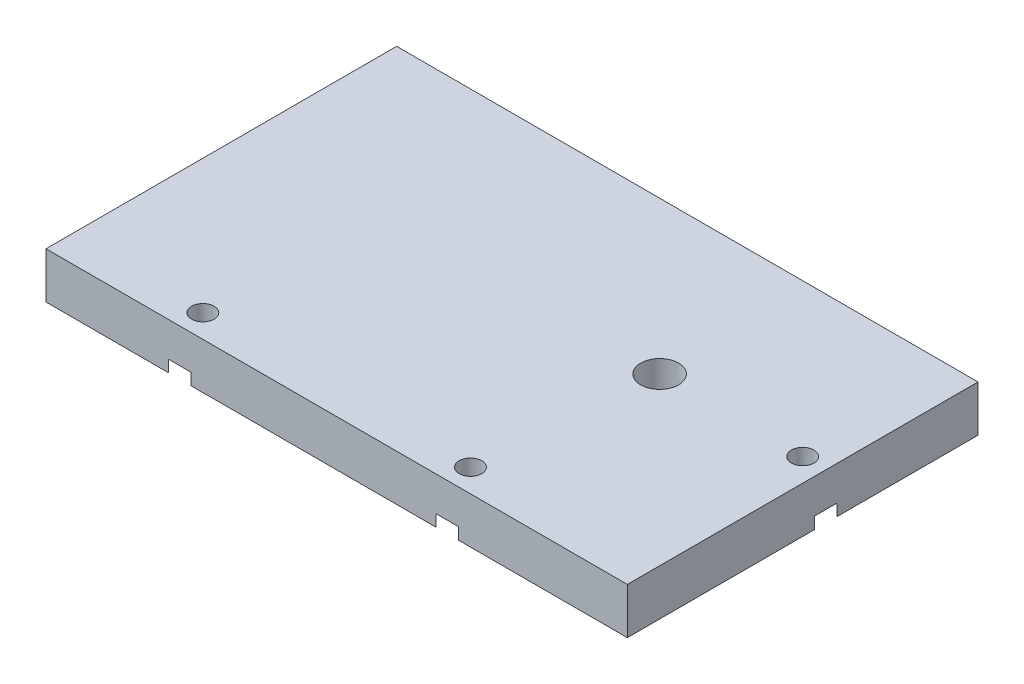
ISO-10303-21;
HEADER;
FILE_DESCRIPTION(('STEP AP214'),'2;1');
FILE_NAME('part.step','',(''),(''),'','','');
FILE_SCHEMA(('AUTOMOTIVE_DESIGN { 1 0 10303 214 1 1 1 1 }'));
ENDSEC;
DATA;
#1=APPLICATION_CONTEXT('core data for automotive mechanical design processes');
#2=APPLICATION_PROTOCOL_DEFINITION('international standard','automotive_design',2000,#1);
#3=PRODUCT_CONTEXT('',#1,'mechanical');
#4=PRODUCT('Part','Part','',(#3));
#5=PRODUCT_RELATED_PRODUCT_CATEGORY('part','',(#4));
#6=PRODUCT_DEFINITION_FORMATION('','',#4);
#7=PRODUCT_DEFINITION_CONTEXT('part definition',#1,'design');
#8=PRODUCT_DEFINITION('design','',#6,#7);
#9=PRODUCT_DEFINITION_SHAPE('','',#8);
#10=(LENGTH_UNIT() NAMED_UNIT(*) SI_UNIT(.MILLI.,.METRE.));
#11=(NAMED_UNIT(*) PLANE_ANGLE_UNIT() SI_UNIT($,.RADIAN.));
#12=(NAMED_UNIT(*) SI_UNIT($,.STERADIAN.) SOLID_ANGLE_UNIT());
#13=UNCERTAINTY_MEASURE_WITH_UNIT(LENGTH_MEASURE(1.E-05),#10,'distance_accuracy_value','');
#14=(GEOMETRIC_REPRESENTATION_CONTEXT(3) GLOBAL_UNCERTAINTY_ASSIGNED_CONTEXT((#13)) GLOBAL_UNIT_ASSIGNED_CONTEXT((#10,
#11,#12)) REPRESENTATION_CONTEXT('',''));
#15=CARTESIAN_POINT('',(0.,0.,0.));
#16=DIRECTION('',(0.,0.,1.));
#17=DIRECTION('',(1.,0.,0.));
#18=AXIS2_PLACEMENT_3D('',#15,#16,#17);
#19=CARTESIAN_POINT('',(-31.5,5.,-19.));
#20=DIRECTION('',(1.,0.,0.));
#21=DIRECTION('',(0.,0.,-1.));
#22=AXIS2_PLACEMENT_3D('',#19,#20,#21);
#23=PLANE('',#22);
#24=DIRECTION('',(0.,0.,1.));
#25=VECTOR('',#24,1.);
#26=CARTESIAN_POINT('',(-31.5,0.,-19.));
#27=LINE('',#26,#25);
#28=CARTESIAN_POINT('',(-31.5,0.,-19.));
#29=VERTEX_POINT('',#28);
#30=CARTESIAN_POINT('',(-31.5,0.,19.));
#31=VERTEX_POINT('',#30);
#32=EDGE_CURVE('E238',#29,#31,#27,.T.);
#33=ORIENTED_EDGE('',*,*,#32,.T.);
#34=DIRECTION('',(0.,-1.,0.));
#35=VECTOR('',#34,1.);
#36=CARTESIAN_POINT('',(-31.5,5.,19.));
#37=LINE('',#36,#35);
#38=CARTESIAN_POINT('',(-31.5,5.,19.));
#39=VERTEX_POINT('',#38);
#40=EDGE_CURVE('E281',#39,#31,#37,.T.);
#41=ORIENTED_EDGE('',*,*,#40,.F.);
#42=DIRECTION('',(0.,0.,1.));
#43=VECTOR('',#42,1.);
#44=CARTESIAN_POINT('',(-31.5,5.,-19.));
#45=LINE('',#44,#43);
#46=CARTESIAN_POINT('',(-31.5,5.,-19.));
#47=VERTEX_POINT('',#46);
#48=EDGE_CURVE('E239',#47,#39,#45,.T.);
#49=ORIENTED_EDGE('',*,*,#48,.F.);
#50=DIRECTION('',(0.,-1.,0.));
#51=VECTOR('',#50,1.);
#52=CARTESIAN_POINT('',(-31.5,5.,-19.));
#53=LINE('',#52,#51);
#54=EDGE_CURVE('E253',#47,#29,#53,.T.);
#55=ORIENTED_EDGE('',*,*,#54,.T.);
#56=EDGE_LOOP('',(#33,#41,#49,#55));
#57=FACE_BOUND('',#56,.T.);
#58=ADVANCED_FACE('F59',(#57),#23,.F.);
#59=CARTESIAN_POINT('',(-31.5,5.,19.));
#60=DIRECTION('',(0.,0.,-1.));
#61=DIRECTION('',(-1.,0.,0.));
#62=AXIS2_PLACEMENT_3D('',#59,#60,#61);
#63=PLANE('',#62);
#64=DIRECTION('',(1.,0.,0.));
#65=VECTOR('',#64,1.);
#66=CARTESIAN_POINT('',(-31.5,1.27,19.));
#67=LINE('',#66,#65);
#68=CARTESIAN_POINT('',(10.7869430608582,1.27,19.));
#69=VERTEX_POINT('',#68);
#70=CARTESIAN_POINT('',(13.2130569391418,1.27,19.));
#71=VERTEX_POINT('',#70);
#72=EDGE_CURVE('E309',#69,#71,#67,.T.);
#73=ORIENTED_EDGE('',*,*,#72,.T.);
#74=DIRECTION('',(0.,-1.,0.));
#75=VECTOR('',#74,1.);
#76=CARTESIAN_POINT('',(13.2130569391418,0.,19.));
#77=LINE('',#76,#75);
#78=CARTESIAN_POINT('',(13.2130569391418,0.,19.));
#79=VERTEX_POINT('',#78);
#80=EDGE_CURVE('E13',#71,#79,#77,.T.);
#81=ORIENTED_EDGE('',*,*,#80,.T.);
#82=DIRECTION('',(1.,0.,0.));
#83=VECTOR('',#82,1.);
#84=CARTESIAN_POINT('',(-31.5,0.,19.));
#85=LINE('',#84,#83);
#86=CARTESIAN_POINT('',(31.5,0.,19.));
#87=VERTEX_POINT('',#86);
#88=EDGE_CURVE('E257',#79,#87,#85,.T.);
#89=ORIENTED_EDGE('',*,*,#88,.T.);
#90=DIRECTION('',(0.,-1.,0.));
#91=VECTOR('',#90,1.);
#92=CARTESIAN_POINT('',(31.5,5.,19.));
#93=LINE('',#92,#91);
#94=CARTESIAN_POINT('',(31.5,5.,19.));
#95=VERTEX_POINT('',#94);
#96=EDGE_CURVE('E277',#95,#87,#93,.T.);
#97=ORIENTED_EDGE('',*,*,#96,.F.);
#98=DIRECTION('',(1.,0.,0.));
#99=VECTOR('',#98,1.);
#100=CARTESIAN_POINT('',(-31.5,5.,19.));
#101=LINE('',#100,#99);
#102=EDGE_CURVE('E243',#39,#95,#101,.T.);
#103=ORIENTED_EDGE('',*,*,#102,.F.);
#104=ORIENTED_EDGE('',*,*,#40,.T.);
#105=CARTESIAN_POINT('',(-18.2130569391417,0.,19.));
#106=VERTEX_POINT('',#105);
#107=EDGE_CURVE('E258',#31,#106,#85,.T.);
#108=ORIENTED_EDGE('',*,*,#107,.T.);
#109=DIRECTION('',(0.,-1.,0.));
#110=VECTOR('',#109,1.);
#111=CARTESIAN_POINT('',(-18.2130569391417,0.,19.));
#112=LINE('',#111,#110);
#113=CARTESIAN_POINT('',(-18.2130569391417,1.27,19.));
#114=VERTEX_POINT('',#113);
#115=EDGE_CURVE('E301',#106,#114,#112,.F.);
#116=ORIENTED_EDGE('',*,*,#115,.T.);
#117=DIRECTION('',(1.,0.,0.));
#118=VECTOR('',#117,1.);
#119=CARTESIAN_POINT('',(-31.5,1.27,19.));
#120=LINE('',#119,#118);
#121=CARTESIAN_POINT('',(-15.7869430608582,1.27,19.));
#122=VERTEX_POINT('',#121);
#123=EDGE_CURVE('E297',#114,#122,#120,.T.);
#124=ORIENTED_EDGE('',*,*,#123,.T.);
#125=DIRECTION('',(0.,-1.,0.));
#126=VECTOR('',#125,1.);
#127=CARTESIAN_POINT('',(-15.7869430608582,0.,19.));
#128=LINE('',#127,#126);
#129=CARTESIAN_POINT('',(-15.7869430608582,0.,19.));
#130=VERTEX_POINT('',#129);
#131=EDGE_CURVE('E305',#122,#130,#128,.T.);
#132=ORIENTED_EDGE('',*,*,#131,.T.);
#133=CARTESIAN_POINT('',(10.7869430608582,0.,19.));
#134=VERTEX_POINT('',#133);
#135=EDGE_CURVE('E263',#130,#134,#85,.T.);
#136=ORIENTED_EDGE('',*,*,#135,.T.);
#137=DIRECTION('',(0.,-1.,0.));
#138=VECTOR('',#137,1.);
#139=CARTESIAN_POINT('',(10.7869430608582,0.,19.));
#140=LINE('',#139,#138);
#141=EDGE_CURVE('E67',#134,#69,#140,.F.);
#142=ORIENTED_EDGE('',*,*,#141,.T.);
#143=EDGE_LOOP('',(#73,#81,#89,#97,#103,#104,#108,#116,#124,#132,#136,#142));
#144=FACE_BOUND('',#143,.T.);
#145=ADVANCED_FACE('F318',(#144),#63,.F.);
#146=CARTESIAN_POINT('',(31.5,5.,-19.));
#147=DIRECTION('',(-1.,0.,0.));
#148=DIRECTION('',(0.,0.,1.));
#149=AXIS2_PLACEMENT_3D('',#146,#147,#148);
#150=PLANE('',#149);
#151=DIRECTION('',(0.,0.,-1.));
#152=VECTOR('',#151,1.);
#153=CARTESIAN_POINT('',(31.5,1.27,-19.));
#154=LINE('',#153,#152);
#155=CARTESIAN_POINT('',(31.5,1.27,-1.28694306085824));
#156=VERTEX_POINT('',#155);
#157=CARTESIAN_POINT('',(31.5,1.27,-3.71305693914176));
#158=VERTEX_POINT('',#157);
#159=EDGE_CURVE('E289',#156,#158,#154,.T.);
#160=ORIENTED_EDGE('',*,*,#159,.T.);
#161=DIRECTION('',(0.,-1.,0.));
#162=VECTOR('',#161,1.);
#163=CARTESIAN_POINT('',(31.5,0.,-3.71305693914176));
#164=LINE('',#163,#162);
#165=CARTESIAN_POINT('',(31.5,0.,-3.71305693914176));
#166=VERTEX_POINT('',#165);
#167=EDGE_CURVE('E293',#158,#166,#164,.T.);
#168=ORIENTED_EDGE('',*,*,#167,.T.);
#169=DIRECTION('',(0.,0.,-1.));
#170=VECTOR('',#169,1.);
#171=CARTESIAN_POINT('',(31.5,0.,-19.));
#172=LINE('',#171,#170);
#173=CARTESIAN_POINT('',(31.5,0.,-19.));
#174=VERTEX_POINT('',#173);
#175=EDGE_CURVE('E262',#166,#174,#172,.T.);
#176=ORIENTED_EDGE('',*,*,#175,.T.);
#177=DIRECTION('',(0.,-1.,0.));
#178=VECTOR('',#177,1.);
#179=CARTESIAN_POINT('',(31.5,5.,-19.));
#180=LINE('',#179,#178);
#181=CARTESIAN_POINT('',(31.5,5.,-19.));
#182=VERTEX_POINT('',#181);
#183=EDGE_CURVE('E273',#182,#174,#180,.T.);
#184=ORIENTED_EDGE('',*,*,#183,.F.);
#185=DIRECTION('',(0.,0.,-1.));
#186=VECTOR('',#185,1.);
#187=CARTESIAN_POINT('',(31.5,5.,-19.));
#188=LINE('',#187,#186);
#189=EDGE_CURVE('E247',#95,#182,#188,.T.);
#190=ORIENTED_EDGE('',*,*,#189,.F.);
#191=ORIENTED_EDGE('',*,*,#96,.T.);
#192=CARTESIAN_POINT('',(31.5,0.,-1.28694306085824));
#193=VERTEX_POINT('',#192);
#194=EDGE_CURVE('E264',#87,#193,#172,.T.);
#195=ORIENTED_EDGE('',*,*,#194,.T.);
#196=DIRECTION('',(0.,-1.,0.));
#197=VECTOR('',#196,1.);
#198=CARTESIAN_POINT('',(31.5,0.,-1.28694306085824));
#199=LINE('',#198,#197);
#200=EDGE_CURVE('E285',#193,#156,#199,.F.);
#201=ORIENTED_EDGE('',*,*,#200,.T.);
#202=EDGE_LOOP('',(#160,#168,#176,#184,#190,#191,#195,#201));
#203=FACE_BOUND('',#202,.T.);
#204=ADVANCED_FACE('F380',(#203),#150,.F.);
#205=CARTESIAN_POINT('',(-31.5,5.,-19.));
#206=DIRECTION('',(0.,0.,1.));
#207=DIRECTION('',(1.,0.,0.));
#208=AXIS2_PLACEMENT_3D('',#205,#206,#207);
#209=PLANE('',#208);
#210=CARTESIAN_POINT('',(12.,2.49999999999999,-19.));
#211=DIRECTION('',(0.,0.,-1.));
#212=DIRECTION('',(-1.,0.,0.));
#213=AXIS2_PLACEMENT_3D('',#210,#211,#212);
#214=CIRCLE('',#213,0.888999999999989);
#215=CARTESIAN_POINT('',(11.111,2.49999999999999,-19.));
#216=VERTEX_POINT('',#215);
#217=EDGE_CURVE('E158',#216,#216,#214,.T.);
#218=ORIENTED_EDGE('',*,*,#217,.F.);
#219=EDGE_LOOP('',(#218));
#220=FACE_BOUND('',#219,.T.);
#221=CARTESIAN_POINT('',(-17.,2.5,-19.));
#222=DIRECTION('',(0.,0.,-1.));
#223=DIRECTION('',(-1.,0.,0.));
#224=AXIS2_PLACEMENT_3D('',#221,#222,#223);
#225=CIRCLE('',#224,0.888999999999987);
#226=CARTESIAN_POINT('',(-17.889,2.5,-19.));
#227=VERTEX_POINT('',#226);
#228=EDGE_CURVE('E157',#227,#227,#225,.T.);
#229=ORIENTED_EDGE('',*,*,#228,.F.);
#230=EDGE_LOOP('',(#229));
#231=FACE_BOUND('',#230,.T.);
#232=DIRECTION('',(-1.,0.,0.));
#233=VECTOR('',#232,1.);
#234=CARTESIAN_POINT('',(-31.5,0.,-19.));
#235=LINE('',#234,#233);
#236=EDGE_CURVE('E244',#174,#29,#235,.T.);
#237=ORIENTED_EDGE('',*,*,#236,.T.);
#238=ORIENTED_EDGE('',*,*,#54,.F.);
#239=DIRECTION('',(-1.,0.,0.));
#240=VECTOR('',#239,1.);
#241=CARTESIAN_POINT('',(-31.5,5.,-19.));
#242=LINE('',#241,#240);
#243=EDGE_CURVE('E250',#182,#47,#242,.T.);
#244=ORIENTED_EDGE('',*,*,#243,.F.);
#245=ORIENTED_EDGE('',*,*,#183,.T.);
#246=EDGE_LOOP('',(#237,#238,#244,#245));
#247=FACE_BOUND('',#246,.T.);
#248=ADVANCED_FACE('F385',(#220,#231,#247),#209,.F.);
#249=CARTESIAN_POINT('',(0.,5.,0.));
#250=DIRECTION('',(0.,1.,0.));
#251=DIRECTION('',(0.,0.,1.));
#252=AXIS2_PLACEMENT_3D('',#249,#250,#251);
#253=PLANE('',#252);
#254=CARTESIAN_POINT('',(13.5,5.,-2.5));
#255=DIRECTION('',(0.,1.,0.));
#256=DIRECTION('',(0.,0.,1.));
#257=AXIS2_PLACEMENT_3D('',#254,#255,#256);
#258=CIRCLE('',#257,2.05);
#259=CARTESIAN_POINT('',(13.5,5.,-0.45));
#260=VERTEX_POINT('',#259);
#261=EDGE_CURVE('E193',#260,#260,#258,.T.);
#262=ORIENTED_EDGE('',*,*,#261,.F.);
#263=EDGE_LOOP('',(#262));
#264=FACE_BOUND('',#263,.T.);
#265=CARTESIAN_POINT('',(12.,5.,16.5));
#266=DIRECTION('',(0.,-1.,0.));
#267=DIRECTION('',(0.,0.,-1.));
#268=AXIS2_PLACEMENT_3D('',#265,#266,#267);
#269=CIRCLE('',#268,1.2192);
#270=CARTESIAN_POINT('',(12.,5.,15.2808));
#271=VERTEX_POINT('',#270);
#272=EDGE_CURVE('E206',#271,#271,#269,.T.);
#273=ORIENTED_EDGE('',*,*,#272,.T.);
#274=EDGE_LOOP('',(#273));
#275=FACE_BOUND('',#274,.T.);
#276=CARTESIAN_POINT('',(-17.,5.,16.5));
#277=DIRECTION('',(0.,-1.,0.));
#278=DIRECTION('',(0.,0.,-1.));
#279=AXIS2_PLACEMENT_3D('',#276,#277,#278);
#280=CIRCLE('',#279,1.2192);
#281=CARTESIAN_POINT('',(-17.,5.,15.2808));
#282=VERTEX_POINT('',#281);
#283=EDGE_CURVE('E219',#282,#282,#280,.T.);
#284=ORIENTED_EDGE('',*,*,#283,.T.);
#285=EDGE_LOOP('',(#284));
#286=FACE_BOUND('',#285,.T.);
#287=CARTESIAN_POINT('',(29.,5.,-2.5));
#288=DIRECTION('',(0.,-1.,0.));
#289=DIRECTION('',(0.,0.,-1.));
#290=AXIS2_PLACEMENT_3D('',#287,#288,#289);
#291=CIRCLE('',#290,1.2192);
#292=CARTESIAN_POINT('',(29.,5.,-3.7192));
#293=VERTEX_POINT('',#292);
#294=EDGE_CURVE('E234',#293,#293,#291,.T.);
#295=ORIENTED_EDGE('',*,*,#294,.T.);
#296=EDGE_LOOP('',(#295));
#297=FACE_BOUND('',#296,.T.);
#298=ORIENTED_EDGE('',*,*,#48,.T.);
#299=ORIENTED_EDGE('',*,*,#102,.T.);
#300=ORIENTED_EDGE('',*,*,#189,.T.);
#301=ORIENTED_EDGE('',*,*,#243,.T.);
#302=EDGE_LOOP('',(#298,#299,#300,#301));
#303=FACE_BOUND('',#302,.T.);
#304=ADVANCED_FACE('F392',(#264,#275,#286,#297,#303),#253,.T.);
#305=CARTESIAN_POINT('',(0.,0.,0.));
#306=DIRECTION('',(0.,1.,0.));
#307=DIRECTION('',(0.,0.,1.));
#308=AXIS2_PLACEMENT_3D('',#305,#306,#307);
#309=PLANE('',#308);
#310=CARTESIAN_POINT('',(13.5,0.,-8.6));
#311=DIRECTION('',(0.,-1.,0.));
#312=DIRECTION('',(0.,0.,-1.));
#313=AXIS2_PLACEMENT_3D('',#310,#311,#312);
#314=CIRCLE('',#313,0.888999999999989);
#315=CARTESIAN_POINT('',(13.5,0.,-9.48899999999999));
#316=VERTEX_POINT('',#315);
#317=EDGE_CURVE('E173',#316,#316,#314,.T.);
#318=ORIENTED_EDGE('',*,*,#317,.F.);
#319=EDGE_LOOP('',(#318));
#320=FACE_BOUND('',#319,.T.);
#321=CARTESIAN_POINT('',(13.5,0.,3.6));
#322=DIRECTION('',(0.,-1.,0.));
#323=DIRECTION('',(0.,0.,-1.));
#324=AXIS2_PLACEMENT_3D('',#321,#322,#323);
#325=CIRCLE('',#324,0.888999999999989);
#326=CARTESIAN_POINT('',(13.5,0.,2.71100000000001));
#327=VERTEX_POINT('',#326);
#328=EDGE_CURVE('E181',#327,#327,#325,.T.);
#329=ORIENTED_EDGE('',*,*,#328,.F.);
#330=EDGE_LOOP('',(#329));
#331=FACE_BOUND('',#330,.T.);
#332=CARTESIAN_POINT('',(13.5,0.,-2.5));
#333=DIRECTION('',(0.,-1.,0.));
#334=DIRECTION('',(0.,0.,-1.));
#335=AXIS2_PLACEMENT_3D('',#332,#333,#334);
#336=CIRCLE('',#335,2.05);
#337=CARTESIAN_POINT('',(13.5,0.,-4.55));
#338=VERTEX_POINT('',#337);
#339=EDGE_CURVE('E189',#338,#338,#336,.T.);
#340=ORIENTED_EDGE('',*,*,#339,.F.);
#341=EDGE_LOOP('',(#340));
#342=FACE_BOUND('',#341,.T.);
#343=ORIENTED_EDGE('',*,*,#88,.F.);
#344=CARTESIAN_POINT('',(12.,0.,16.5));
#345=DIRECTION('',(0.,-1.,0.));
#346=DIRECTION('',(0.,0.,-1.));
#347=AXIS2_PLACEMENT_3D('',#344,#345,#346);
#348=CIRCLE('',#347,2.77875999999999);
#349=EDGE_CURVE('E197',#134,#79,#348,.T.);
#350=ORIENTED_EDGE('',*,*,#349,.F.);
#351=ORIENTED_EDGE('',*,*,#135,.F.);
#352=CARTESIAN_POINT('',(-17.,0.,16.5));
#353=DIRECTION('',(0.,-1.,0.));
#354=DIRECTION('',(0.,0.,-1.));
#355=AXIS2_PLACEMENT_3D('',#352,#353,#354);
#356=CIRCLE('',#355,2.77875999999999);
#357=EDGE_CURVE('E210',#106,#130,#356,.T.);
#358=ORIENTED_EDGE('',*,*,#357,.F.);
#359=ORIENTED_EDGE('',*,*,#107,.F.);
#360=ORIENTED_EDGE('',*,*,#32,.F.);
#361=ORIENTED_EDGE('',*,*,#236,.F.);
#362=ORIENTED_EDGE('',*,*,#175,.F.);
#363=CARTESIAN_POINT('',(29.,0.,-2.5));
#364=DIRECTION('',(0.,-1.,0.));
#365=DIRECTION('',(0.,0.,-1.));
#366=AXIS2_PLACEMENT_3D('',#363,#364,#365);
#367=CIRCLE('',#366,2.77875999999999);
#368=EDGE_CURVE('E223',#193,#166,#367,.T.);
#369=ORIENTED_EDGE('',*,*,#368,.F.);
#370=ORIENTED_EDGE('',*,*,#194,.F.);
#371=EDGE_LOOP('',(#343,#350,#351,#358,#359,#360,#361,#362,#369,#370));
#372=FACE_BOUND('',#371,.T.);
#373=ADVANCED_FACE('F325',(#320,#331,#342,#372),#309,.F.);
#374=CARTESIAN_POINT('',(30.2192,1.27,-2.5));
#375=DIRECTION('',(0.,1.,0.));
#376=DIRECTION('',(0.,0.,1.));
#377=AXIS2_PLACEMENT_3D('',#374,#375,#376);
#378=PLANE('',#377);
#379=CARTESIAN_POINT('',(29.,1.27,-2.5));
#380=DIRECTION('',(0.,-1.,0.));
#381=DIRECTION('',(0.,0.,-1.));
#382=AXIS2_PLACEMENT_3D('',#379,#380,#381);
#383=CIRCLE('',#382,1.21920000000001);
#384=CARTESIAN_POINT('',(29.,1.27,-3.71920000000002));
#385=VERTEX_POINT('',#384);
#386=EDGE_CURVE('E230',#385,#385,#383,.T.);
#387=ORIENTED_EDGE('',*,*,#386,.F.);
#388=EDGE_LOOP('',(#387));
#389=FACE_BOUND('',#388,.T.);
#390=CARTESIAN_POINT('',(29.,1.27,-2.5));
#391=DIRECTION('',(0.,-1.,0.));
#392=DIRECTION('',(0.,0.,-1.));
#393=AXIS2_PLACEMENT_3D('',#390,#391,#392);
#394=CIRCLE('',#393,2.77875999999999);
#395=EDGE_CURVE('E226',#156,#158,#394,.T.);
#396=ORIENTED_EDGE('',*,*,#395,.T.);
#397=ORIENTED_EDGE('',*,*,#159,.F.);
#398=EDGE_LOOP('',(#396,#397));
#399=FACE_BOUND('',#398,.T.);
#400=ADVANCED_FACE('F424',(#389,#399),#378,.F.);
#401=CARTESIAN_POINT('',(29.,0.,-2.5));
#402=DIRECTION('',(0.,-1.,0.));
#403=DIRECTION('',(0.,0.,-1.));
#404=AXIS2_PLACEMENT_3D('',#401,#402,#403);
#405=CYLINDRICAL_SURFACE('',#404,2.77875999999999);
#406=ORIENTED_EDGE('',*,*,#395,.F.);
#407=ORIENTED_EDGE('',*,*,#200,.F.);
#408=ORIENTED_EDGE('',*,*,#368,.T.);
#409=ORIENTED_EDGE('',*,*,#167,.F.);
#410=EDGE_LOOP('',(#406,#407,#408,#409));
#411=FACE_BOUND('',#410,.T.);
#412=ADVANCED_FACE('F406',(#411),#405,.F.);
#413=CARTESIAN_POINT('',(29.,0.,-2.5));
#414=DIRECTION('',(0.,-1.,0.));
#415=DIRECTION('',(0.,0.,-1.));
#416=AXIS2_PLACEMENT_3D('',#413,#414,#415);
#417=CYLINDRICAL_SURFACE('',#416,1.21920000000001);
#418=ORIENTED_EDGE('',*,*,#294,.F.);
#419=EDGE_LOOP('',(#418));
#420=FACE_BOUND('',#419,.T.);
#421=ORIENTED_EDGE('',*,*,#386,.T.);
#422=EDGE_LOOP('',(#421));
#423=FACE_BOUND('',#422,.T.);
#424=ADVANCED_FACE('F397',(#420,#423),#417,.F.);
#425=CARTESIAN_POINT('',(-17.,0.,16.5));
#426=DIRECTION('',(0.,-1.,0.));
#427=DIRECTION('',(0.,0.,-1.));
#428=AXIS2_PLACEMENT_3D('',#425,#426,#427);
#429=CYLINDRICAL_SURFACE('',#428,2.77875999999999);
#430=CARTESIAN_POINT('',(-17.,1.27,16.5));
#431=DIRECTION('',(0.,-1.,0.));
#432=DIRECTION('',(0.,0.,-1.));
#433=AXIS2_PLACEMENT_3D('',#430,#431,#432);
#434=CIRCLE('',#433,2.77875999999999);
#435=EDGE_CURVE('E80',#114,#122,#434,.T.);
#436=ORIENTED_EDGE('',*,*,#435,.F.);
#437=ORIENTED_EDGE('',*,*,#115,.F.);
#438=ORIENTED_EDGE('',*,*,#357,.T.);
#439=ORIENTED_EDGE('',*,*,#131,.F.);
#440=EDGE_LOOP('',(#436,#437,#438,#439));
#441=FACE_BOUND('',#440,.T.);
#442=ADVANCED_FACE('F394',(#441),#429,.F.);
#443=CARTESIAN_POINT('',(-15.7808,1.27,16.5));
#444=DIRECTION('',(0.,1.,0.));
#445=DIRECTION('',(0.,0.,1.));
#446=AXIS2_PLACEMENT_3D('',#443,#444,#445);
#447=PLANE('',#446);
#448=CARTESIAN_POINT('',(-17.,1.27,16.5));
#449=DIRECTION('',(0.,-1.,0.));
#450=DIRECTION('',(0.,0.,-1.));
#451=AXIS2_PLACEMENT_3D('',#448,#449,#450);
#452=CIRCLE('',#451,1.21920000000001);
#453=CARTESIAN_POINT('',(-17.,1.27,15.2808));
#454=VERTEX_POINT('',#453);
#455=EDGE_CURVE('E215',#454,#454,#452,.T.);
#456=ORIENTED_EDGE('',*,*,#455,.F.);
#457=EDGE_LOOP('',(#456));
#458=FACE_BOUND('',#457,.T.);
#459=ORIENTED_EDGE('',*,*,#435,.T.);
#460=ORIENTED_EDGE('',*,*,#123,.F.);
#461=EDGE_LOOP('',(#459,#460));
#462=FACE_BOUND('',#461,.T.);
#463=ADVANCED_FACE('F396',(#458,#462),#447,.F.);
#464=CARTESIAN_POINT('',(-17.,0.,16.5));
#465=DIRECTION('',(0.,-1.,0.));
#466=DIRECTION('',(0.,0.,-1.));
#467=AXIS2_PLACEMENT_3D('',#464,#465,#466);
#468=CYLINDRICAL_SURFACE('',#467,1.21920000000001);
#469=ORIENTED_EDGE('',*,*,#283,.F.);
#470=EDGE_LOOP('',(#469));
#471=FACE_BOUND('',#470,.T.);
#472=ORIENTED_EDGE('',*,*,#455,.T.);
#473=EDGE_LOOP('',(#472));
#474=FACE_BOUND('',#473,.T.);
#475=ADVANCED_FACE('F403',(#471,#474),#468,.F.);
#476=CARTESIAN_POINT('',(12.,0.,16.5));
#477=DIRECTION('',(0.,-1.,0.));
#478=DIRECTION('',(0.,0.,-1.));
#479=AXIS2_PLACEMENT_3D('',#476,#477,#478);
#480=CYLINDRICAL_SURFACE('',#479,2.77875999999999);
#481=CARTESIAN_POINT('',(12.,1.27,16.5));
#482=DIRECTION('',(0.,-1.,0.));
#483=DIRECTION('',(0.,0.,-1.));
#484=AXIS2_PLACEMENT_3D('',#481,#482,#483);
#485=CIRCLE('',#484,2.77875999999999);
#486=EDGE_CURVE('E73',#69,#71,#485,.T.);
#487=ORIENTED_EDGE('',*,*,#486,.F.);
#488=ORIENTED_EDGE('',*,*,#141,.F.);
#489=ORIENTED_EDGE('',*,*,#349,.T.);
#490=ORIENTED_EDGE('',*,*,#80,.F.);
#491=EDGE_LOOP('',(#487,#488,#489,#490));
#492=FACE_BOUND('',#491,.T.);
#493=ADVANCED_FACE('F322',(#492),#480,.F.);
#494=CARTESIAN_POINT('',(13.2192,1.27,16.5));
#495=DIRECTION('',(0.,1.,0.));
#496=DIRECTION('',(0.,0.,1.));
#497=AXIS2_PLACEMENT_3D('',#494,#495,#496);
#498=PLANE('',#497);
#499=CARTESIAN_POINT('',(12.,1.27,16.5));
#500=DIRECTION('',(0.,-1.,0.));
#501=DIRECTION('',(0.,0.,-1.));
#502=AXIS2_PLACEMENT_3D('',#499,#500,#501);
#503=CIRCLE('',#502,1.21920000000001);
#504=CARTESIAN_POINT('',(12.,1.27,15.2808));
#505=VERTEX_POINT('',#504);
#506=EDGE_CURVE('E202',#505,#505,#503,.T.);
#507=ORIENTED_EDGE('',*,*,#506,.F.);
#508=EDGE_LOOP('',(#507));
#509=FACE_BOUND('',#508,.T.);
#510=ORIENTED_EDGE('',*,*,#486,.T.);
#511=ORIENTED_EDGE('',*,*,#72,.F.);
#512=EDGE_LOOP('',(#510,#511));
#513=FACE_BOUND('',#512,.T.);
#514=ADVANCED_FACE('F440',(#509,#513),#498,.F.);
#515=CARTESIAN_POINT('',(12.,0.,16.5));
#516=DIRECTION('',(0.,-1.,0.));
#517=DIRECTION('',(0.,0.,-1.));
#518=AXIS2_PLACEMENT_3D('',#515,#516,#517);
#519=CYLINDRICAL_SURFACE('',#518,1.21920000000001);
#520=ORIENTED_EDGE('',*,*,#272,.F.);
#521=EDGE_LOOP('',(#520));
#522=FACE_BOUND('',#521,.T.);
#523=ORIENTED_EDGE('',*,*,#506,.T.);
#524=EDGE_LOOP('',(#523));
#525=FACE_BOUND('',#524,.T.);
#526=ADVANCED_FACE('F455',(#522,#525),#519,.F.);
#527=CARTESIAN_POINT('',(13.5,10.,-2.5));
#528=DIRECTION('',(0.,-1.,0.));
#529=DIRECTION('',(0.,0.,-1.));
#530=AXIS2_PLACEMENT_3D('',#527,#528,#529);
#531=CYLINDRICAL_SURFACE('',#530,2.05);
#532=ORIENTED_EDGE('',*,*,#261,.T.);
#533=EDGE_LOOP('',(#532));
#534=FACE_BOUND('',#533,.T.);
#535=ORIENTED_EDGE('',*,*,#339,.T.);
#536=EDGE_LOOP('',(#535));
#537=FACE_BOUND('',#536,.T.);
#538=ADVANCED_FACE('F459',(#534,#537),#531,.F.);
#539=CARTESIAN_POINT('',(13.5,2.4658349096845,3.6));
#540=DIRECTION('',(0.,-1.,0.));
#541=DIRECTION('',(0.,0.,-1.));
#542=AXIS2_PLACEMENT_3D('',#539,#540,#541);
#543=CONICAL_SURFACE('',#542,0.888999999999999,1.02974425867665);
#544=CARTESIAN_POINT('',(13.5,3.,3.6));
#545=VERTEX_POINT('',#544);
#546=VERTEX_LOOP('',#545);
#547=FACE_BOUND('',#546,.T.);
#548=CARTESIAN_POINT('',(13.5,2.4658349096845,3.6));
#549=DIRECTION('',(0.,-1.,0.));
#550=DIRECTION('',(0.,0.,-1.));
#551=AXIS2_PLACEMENT_3D('',#548,#549,#550);
#552=CIRCLE('',#551,0.888999999999999);
#553=CARTESIAN_POINT('',(13.5,2.4658349096845,2.711));
#554=VERTEX_POINT('',#553);
#555=EDGE_CURVE('E185',#554,#554,#552,.T.);
#556=ORIENTED_EDGE('',*,*,#555,.T.);
#557=EDGE_LOOP('',(#556));
#558=FACE_BOUND('',#557,.T.);
#559=ADVANCED_FACE('F466',(#547,#558),#543,.F.);
#560=CARTESIAN_POINT('',(13.5,0.,3.6));
#561=DIRECTION('',(0.,-1.,0.));
#562=DIRECTION('',(0.,0.,-1.));
#563=AXIS2_PLACEMENT_3D('',#560,#561,#562);
#564=CYLINDRICAL_SURFACE('',#563,0.888999999999994);
#565=ORIENTED_EDGE('',*,*,#555,.F.);
#566=EDGE_LOOP('',(#565));
#567=FACE_BOUND('',#566,.T.);
#568=ORIENTED_EDGE('',*,*,#328,.T.);
#569=EDGE_LOOP('',(#568));
#570=FACE_BOUND('',#569,.T.);
#571=ADVANCED_FACE('F475',(#567,#570),#564,.F.);
#572=CARTESIAN_POINT('',(13.5,2.4658349096845,-8.6));
#573=DIRECTION('',(0.,-1.,0.));
#574=DIRECTION('',(0.,0.,-1.));
#575=AXIS2_PLACEMENT_3D('',#572,#573,#574);
#576=CONICAL_SURFACE('',#575,0.888999999999999,1.02974425867665);
#577=CARTESIAN_POINT('',(13.5,3.,-8.6));
#578=VERTEX_POINT('',#577);
#579=VERTEX_LOOP('',#578);
#580=FACE_BOUND('',#579,.T.);
#581=CARTESIAN_POINT('',(13.5,2.4658349096845,-8.6));
#582=DIRECTION('',(0.,-1.,0.));
#583=DIRECTION('',(0.,0.,-1.));
#584=AXIS2_PLACEMENT_3D('',#581,#582,#583);
#585=CIRCLE('',#584,0.888999999999999);
#586=CARTESIAN_POINT('',(13.5,2.4658349096845,-9.489));
#587=VERTEX_POINT('',#586);
#588=EDGE_CURVE('E177',#587,#587,#585,.T.);
#589=ORIENTED_EDGE('',*,*,#588,.T.);
#590=EDGE_LOOP('',(#589));
#591=FACE_BOUND('',#590,.T.);
#592=ADVANCED_FACE('F484',(#580,#591),#576,.F.);
#593=CARTESIAN_POINT('',(13.5,0.,-8.6));
#594=DIRECTION('',(0.,-1.,0.));
#595=DIRECTION('',(0.,0.,-1.));
#596=AXIS2_PLACEMENT_3D('',#593,#594,#595);
#597=CYLINDRICAL_SURFACE('',#596,0.888999999999994);
#598=ORIENTED_EDGE('',*,*,#588,.F.);
#599=EDGE_LOOP('',(#598));
#600=FACE_BOUND('',#599,.T.);
#601=ORIENTED_EDGE('',*,*,#317,.T.);
#602=EDGE_LOOP('',(#601));
#603=FACE_BOUND('',#602,.T.);
#604=ADVANCED_FACE('F491',(#600,#603),#597,.F.);
#605=CARTESIAN_POINT('',(-17.,2.5,-11.5341650903155));
#606=DIRECTION('',(0.,0.,-1.));
#607=DIRECTION('',(-1.,0.,0.));
#608=AXIS2_PLACEMENT_3D('',#605,#606,#607);
#609=CONICAL_SURFACE('',#608,0.888999999999997,1.02974425867665);
#610=CARTESIAN_POINT('',(-17.,2.5,-11.));
#611=VERTEX_POINT('',#610);
#612=VERTEX_LOOP('',#611);
#613=FACE_BOUND('',#612,.T.);
#614=CARTESIAN_POINT('',(-17.,2.5,-11.5341650903155));
#615=DIRECTION('',(0.,0.,-1.));
#616=DIRECTION('',(-1.,0.,0.));
#617=AXIS2_PLACEMENT_3D('',#614,#615,#616);
#618=CIRCLE('',#617,0.888999999999997);
#619=CARTESIAN_POINT('',(-17.889,2.5,-11.5341650903155));
#620=VERTEX_POINT('',#619);
#621=EDGE_CURVE('E165',#620,#620,#618,.T.);
#622=ORIENTED_EDGE('',*,*,#621,.T.);
#623=EDGE_LOOP('',(#622));
#624=FACE_BOUND('',#623,.T.);
#625=ADVANCED_FACE('F495',(#613,#624),#609,.F.);
#626=CARTESIAN_POINT('',(-17.,2.5,-19.));
#627=DIRECTION('',(0.,0.,-1.));
#628=DIRECTION('',(-1.,0.,0.));
#629=AXIS2_PLACEMENT_3D('',#626,#627,#628);
#630=CYLINDRICAL_SURFACE('',#629,0.888999999999992);
#631=ORIENTED_EDGE('',*,*,#621,.F.);
#632=EDGE_LOOP('',(#631));
#633=FACE_BOUND('',#632,.T.);
#634=ORIENTED_EDGE('',*,*,#228,.T.);
#635=EDGE_LOOP('',(#634));
#636=FACE_BOUND('',#635,.T.);
#637=ADVANCED_FACE('F150',(#633,#636),#630,.F.);
#638=CARTESIAN_POINT('',(12.,2.49999999999999,-11.5341650903155));
#639=DIRECTION('',(0.,0.,-1.));
#640=DIRECTION('',(-1.,0.,0.));
#641=AXIS2_PLACEMENT_3D('',#638,#639,#640);
#642=CONICAL_SURFACE('',#641,0.888999999999997,1.02974425867665);
#643=CARTESIAN_POINT('',(12.,2.49999999999999,-11.));
#644=VERTEX_POINT('',#643);
#645=VERTEX_LOOP('',#644);
#646=FACE_BOUND('',#645,.T.);
#647=CARTESIAN_POINT('',(12.,2.49999999999999,-11.5341650903155));
#648=DIRECTION('',(0.,0.,-1.));
#649=DIRECTION('',(-1.,0.,0.));
#650=AXIS2_PLACEMENT_3D('',#647,#648,#649);
#651=CIRCLE('',#650,0.888999999999997);
#652=CARTESIAN_POINT('',(11.111,2.49999999999999,-11.5341650903155));
#653=VERTEX_POINT('',#652);
#654=EDGE_CURVE('E154',#653,#653,#651,.T.);
#655=ORIENTED_EDGE('',*,*,#654,.T.);
#656=EDGE_LOOP('',(#655));
#657=FACE_BOUND('',#656,.T.);
#658=ADVANCED_FACE('F146',(#646,#657),#642,.F.);
#659=CARTESIAN_POINT('',(12.,2.49999999999999,-19.));
#660=DIRECTION('',(0.,0.,-1.));
#661=DIRECTION('',(-1.,0.,0.));
#662=AXIS2_PLACEMENT_3D('',#659,#660,#661);
#663=CYLINDRICAL_SURFACE('',#662,0.888999999999993);
#664=ORIENTED_EDGE('',*,*,#654,.F.);
#665=EDGE_LOOP('',(#664));
#666=FACE_BOUND('',#665,.T.);
#667=ORIENTED_EDGE('',*,*,#217,.T.);
#668=EDGE_LOOP('',(#667));
#669=FACE_BOUND('',#668,.T.);
#670=ADVANCED_FACE('F149',(#666,#669),#663,.F.);
#671=CLOSED_SHELL('',(#58,#145,#204,#248,#304,#373,#400,#412,#424,#442,#463,#475,#493,#514,#526,
#538,#559,#571,#592,#604,#625,#637,#658,#670));
#672=MANIFOLD_SOLID_BREP('B2',#671);
#673=ADVANCED_BREP_SHAPE_REPRESENTATION('',(#18,#672),#14);
#674=SHAPE_DEFINITION_REPRESENTATION(#9,#673);
ENDSEC;
END-ISO-10303-21;
